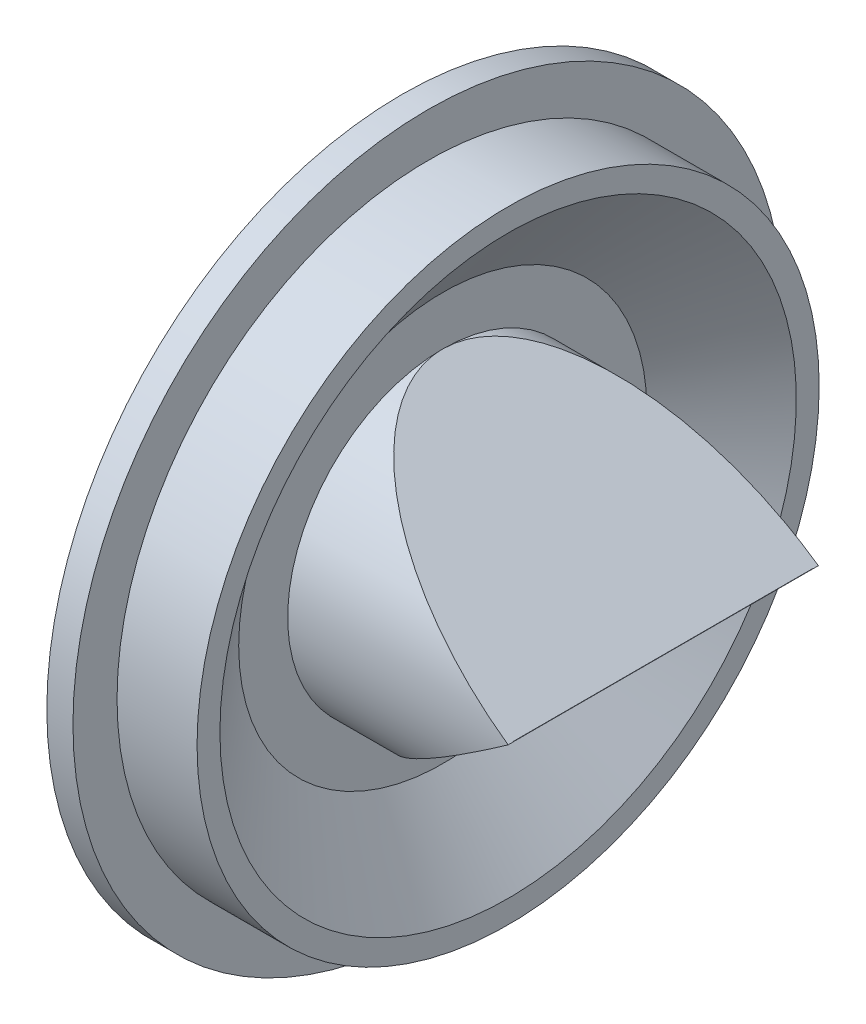
ISO-10303-21;
HEADER;
FILE_DESCRIPTION(('STEP AP214'),'2;1');
FILE_NAME('part.step','',(''),(''),'','','');
FILE_SCHEMA(('AUTOMOTIVE_DESIGN { 1 0 10303 214 1 1 1 1 }'));
ENDSEC;
DATA;
#1=APPLICATION_CONTEXT('core data for automotive mechanical design processes');
#2=APPLICATION_PROTOCOL_DEFINITION('international standard','automotive_design',2000,#1);
#3=PRODUCT_CONTEXT('',#1,'mechanical');
#4=PRODUCT('Part','Part','',(#3));
#5=PRODUCT_RELATED_PRODUCT_CATEGORY('part','',(#4));
#6=PRODUCT_DEFINITION_FORMATION('','',#4);
#7=PRODUCT_DEFINITION_CONTEXT('part definition',#1,'design');
#8=PRODUCT_DEFINITION('design','',#6,#7);
#9=PRODUCT_DEFINITION_SHAPE('','',#8);
#10=(LENGTH_UNIT() NAMED_UNIT(*) SI_UNIT(.MILLI.,.METRE.));
#11=(NAMED_UNIT(*) PLANE_ANGLE_UNIT() SI_UNIT($,.RADIAN.));
#12=(NAMED_UNIT(*) SI_UNIT($,.STERADIAN.) SOLID_ANGLE_UNIT());
#13=UNCERTAINTY_MEASURE_WITH_UNIT(LENGTH_MEASURE(1.E-05),#10,'distance_accuracy_value','');
#14=(GEOMETRIC_REPRESENTATION_CONTEXT(3) GLOBAL_UNCERTAINTY_ASSIGNED_CONTEXT((#13)) GLOBAL_UNIT_ASSIGNED_CONTEXT((#10,
#11,#12)) REPRESENTATION_CONTEXT('',''));
#15=CARTESIAN_POINT('',(0.,0.,0.));
#16=DIRECTION('',(0.,0.,1.));
#17=DIRECTION('',(1.,0.,0.));
#18=AXIS2_PLACEMENT_3D('',#15,#16,#17);
#19=CARTESIAN_POINT('',(0.,0.,0.));
#20=DIRECTION('',(-1.,0.,0.));
#21=DIRECTION('',(0.,0.,1.));
#22=AXIS2_PLACEMENT_3D('',#19,#20,#21);
#23=CYLINDRICAL_SURFACE('',#22,18.75);
#24=CARTESIAN_POINT('',(6.2,0.,0.));
#25=DIRECTION('',(-1.,0.,0.));
#26=DIRECTION('',(0.,0.,1.));
#27=AXIS2_PLACEMENT_3D('',#24,#25,#26);
#28=CIRCLE('',#27,18.75);
#29=CARTESIAN_POINT('',(6.2,0.,18.75));
#30=VERTEX_POINT('',#29);
#31=EDGE_CURVE('E125',#30,#30,#28,.T.);
#32=ORIENTED_EDGE('',*,*,#31,.F.);
#33=EDGE_LOOP('',(#32));
#34=FACE_BOUND('',#33,.T.);
#35=CARTESIAN_POINT('',(0.,0.,0.));
#36=DIRECTION('',(-1.,0.,0.));
#37=DIRECTION('',(0.,0.,1.));
#38=AXIS2_PLACEMENT_3D('',#35,#36,#37);
#39=CIRCLE('',#38,18.75);
#40=CARTESIAN_POINT('',(0.,0.,18.75));
#41=VERTEX_POINT('',#40);
#42=EDGE_CURVE('E159',#41,#41,#39,.T.);
#43=ORIENTED_EDGE('',*,*,#42,.T.);
#44=EDGE_LOOP('',(#43));
#45=FACE_BOUND('',#44,.T.);
#46=ADVANCED_FACE('F40',(#34,#45),#23,.F.);
#47=CARTESIAN_POINT('',(0.,18.75,0.));
#48=DIRECTION('',(1.,0.,0.));
#49=DIRECTION('',(0.,0.,-1.));
#50=AXIS2_PLACEMENT_3D('',#47,#48,#49);
#51=PLANE('',#50);
#52=ORIENTED_EDGE('',*,*,#42,.F.);
#53=EDGE_LOOP('',(#52));
#54=FACE_BOUND('',#53,.T.);
#55=CARTESIAN_POINT('',(0.,0.,0.));
#56=DIRECTION('',(-1.,0.,0.));
#57=DIRECTION('',(0.,0.,1.));
#58=AXIS2_PLACEMENT_3D('',#55,#56,#57);
#59=CIRCLE('',#58,21.75);
#60=CARTESIAN_POINT('',(0.,0.,21.75));
#61=VERTEX_POINT('',#60);
#62=EDGE_CURVE('E156',#61,#61,#59,.T.);
#63=ORIENTED_EDGE('',*,*,#62,.T.);
#64=EDGE_LOOP('',(#63));
#65=FACE_BOUND('',#64,.T.);
#66=ADVANCED_FACE('F210',(#54,#65),#51,.F.);
#67=CARTESIAN_POINT('',(0.,0.,0.));
#68=DIRECTION('',(-1.,0.,0.));
#69=DIRECTION('',(0.,0.,1.));
#70=AXIS2_PLACEMENT_3D('',#67,#68,#69);
#71=CYLINDRICAL_SURFACE('',#70,21.75);
#72=ORIENTED_EDGE('',*,*,#62,.F.);
#73=EDGE_LOOP('',(#72));
#74=FACE_BOUND('',#73,.T.);
#75=CARTESIAN_POINT('',(1.6,0.,0.));
#76=DIRECTION('',(-1.,0.,0.));
#77=DIRECTION('',(0.,0.,1.));
#78=AXIS2_PLACEMENT_3D('',#75,#76,#77);
#79=CIRCLE('',#78,21.75);
#80=CARTESIAN_POINT('',(1.6,0.,21.75));
#81=VERTEX_POINT('',#80);
#82=EDGE_CURVE('E153',#81,#81,#79,.T.);
#83=ORIENTED_EDGE('',*,*,#82,.T.);
#84=EDGE_LOOP('',(#83));
#85=FACE_BOUND('',#84,.T.);
#86=ADVANCED_FACE('F216',(#74,#85),#71,.T.);
#87=CARTESIAN_POINT('',(1.6,21.75,0.));
#88=DIRECTION('',(-1.,0.,0.));
#89=DIRECTION('',(0.,0.,1.));
#90=AXIS2_PLACEMENT_3D('',#87,#88,#89);
#91=PLANE('',#90);
#92=ORIENTED_EDGE('',*,*,#82,.F.);
#93=EDGE_LOOP('',(#92));
#94=FACE_BOUND('',#93,.T.);
#95=CARTESIAN_POINT('',(1.6,0.,0.));
#96=DIRECTION('',(-1.,0.,0.));
#97=DIRECTION('',(0.,0.,1.));
#98=AXIS2_PLACEMENT_3D('',#95,#96,#97);
#99=CIRCLE('',#98,19.05);
#100=CARTESIAN_POINT('',(1.6,0.,19.05));
#101=VERTEX_POINT('',#100);
#102=EDGE_CURVE('E150',#101,#101,#99,.T.);
#103=ORIENTED_EDGE('',*,*,#102,.T.);
#104=EDGE_LOOP('',(#103));
#105=FACE_BOUND('',#104,.T.);
#106=ADVANCED_FACE('F266',(#94,#105),#91,.F.);
#107=CARTESIAN_POINT('',(0.,0.,0.));
#108=DIRECTION('',(-1.,0.,0.));
#109=DIRECTION('',(0.,0.,1.));
#110=AXIS2_PLACEMENT_3D('',#107,#108,#109);
#111=CYLINDRICAL_SURFACE('',#110,19.05);
#112=ORIENTED_EDGE('',*,*,#102,.F.);
#113=EDGE_LOOP('',(#112));
#114=FACE_BOUND('',#113,.T.);
#115=CARTESIAN_POINT('',(6.5,0.,0.));
#116=DIRECTION('',(-1.,0.,0.));
#117=DIRECTION('',(0.,0.,1.));
#118=AXIS2_PLACEMENT_3D('',#115,#116,#117);
#119=CIRCLE('',#118,19.05);
#120=CARTESIAN_POINT('',(6.5,0.,19.05));
#121=VERTEX_POINT('',#120);
#122=EDGE_CURVE('E147',#121,#121,#119,.T.);
#123=ORIENTED_EDGE('',*,*,#122,.T.);
#124=EDGE_LOOP('',(#123));
#125=FACE_BOUND('',#124,.T.);
#126=ADVANCED_FACE('F262',(#114,#125),#111,.T.);
#127=CARTESIAN_POINT('',(6.5,19.05,0.));
#128=DIRECTION('',(-1.,0.,0.));
#129=DIRECTION('',(0.,0.,1.));
#130=AXIS2_PLACEMENT_3D('',#127,#128,#129);
#131=PLANE('',#130);
#132=ORIENTED_EDGE('',*,*,#122,.F.);
#133=EDGE_LOOP('',(#132));
#134=FACE_BOUND('',#133,.T.);
#135=CARTESIAN_POINT('',(6.5,0.,0.));
#136=DIRECTION('',(-1.,0.,0.));
#137=DIRECTION('',(0.,0.,1.));
#138=AXIS2_PLACEMENT_3D('',#135,#136,#137);
#139=CIRCLE('',#138,17.65);
#140=CARTESIAN_POINT('',(6.5,0.,17.65));
#141=VERTEX_POINT('',#140);
#142=EDGE_CURVE('E144',#141,#141,#139,.T.);
#143=ORIENTED_EDGE('',*,*,#142,.T.);
#144=EDGE_LOOP('',(#143));
#145=FACE_BOUND('',#144,.T.);
#146=ADVANCED_FACE('F258',(#134,#145),#131,.F.);
#147=CARTESIAN_POINT('',(2.5,0.,0.));
#148=DIRECTION('',(1.,0.,0.));
#149=DIRECTION('',(0.,0.,-1.));
#150=AXIS2_PLACEMENT_3D('',#147,#148,#149);
#151=CONICAL_SURFACE('',#150,12.5,0.910425652799119);
#152=ORIENTED_EDGE('',*,*,#142,.F.);
#153=EDGE_LOOP('',(#152));
#154=FACE_BOUND('',#153,.T.);
#155=CARTESIAN_POINT('',(2.5,0.,0.));
#156=DIRECTION('',(-1.,0.,0.));
#157=DIRECTION('',(0.,0.,1.));
#158=AXIS2_PLACEMENT_3D('',#155,#156,#157);
#159=CIRCLE('',#158,12.5);
#160=CARTESIAN_POINT('',(2.5,0.,12.5));
#161=VERTEX_POINT('',#160);
#162=EDGE_CURVE('E141',#161,#161,#159,.T.);
#163=ORIENTED_EDGE('',*,*,#162,.T.);
#164=EDGE_LOOP('',(#163));
#165=FACE_BOUND('',#164,.T.);
#166=ADVANCED_FACE('F254',(#154,#165),#151,.F.);
#167=CARTESIAN_POINT('',(2.5,12.5,0.));
#168=DIRECTION('',(-1.,0.,0.));
#169=DIRECTION('',(0.,0.,1.));
#170=AXIS2_PLACEMENT_3D('',#167,#168,#169);
#171=PLANE('',#170);
#172=ORIENTED_EDGE('',*,*,#162,.F.);
#173=EDGE_LOOP('',(#172));
#174=FACE_BOUND('',#173,.T.);
#175=CARTESIAN_POINT('',(2.5,0.,0.));
#176=DIRECTION('',(-1.,0.,0.));
#177=DIRECTION('',(0.,0.,1.));
#178=AXIS2_PLACEMENT_3D('',#175,#176,#177);
#179=CIRCLE('',#178,9.5);
#180=CARTESIAN_POINT('',(2.5,9.5,0.));
#181=VERTEX_POINT('',#180);
#182=CARTESIAN_POINT('',(2.5,-9.5,0.));
#183=VERTEX_POINT('',#182);
#184=EDGE_CURVE('E139',#181,#183,#179,.T.);
#185=ORIENTED_EDGE('',*,*,#184,.T.);
#186=EDGE_CURVE('E138',#183,#181,#179,.T.);
#187=ORIENTED_EDGE('',*,*,#186,.T.);
#188=EDGE_LOOP('',(#185,#187));
#189=FACE_BOUND('',#188,.T.);
#190=ADVANCED_FACE('F250',(#174,#189),#171,.F.);
#191=CARTESIAN_POINT('',(2.2,12.6028195886068,0.));
#192=DIRECTION('',(1.,0.,0.));
#193=DIRECTION('',(0.,0.,-1.));
#194=AXIS2_PLACEMENT_3D('',#191,#192,#193);
#195=PLANE('',#194);
#196=CARTESIAN_POINT('',(2.2,0.,0.));
#197=DIRECTION('',(-1.,0.,0.));
#198=DIRECTION('',(0.,0.,1.));
#199=AXIS2_PLACEMENT_3D('',#196,#197,#198);
#200=CIRCLE('',#199,12.6028195886068);
#201=CARTESIAN_POINT('',(2.2,0.,12.6028195886068));
#202=VERTEX_POINT('',#201);
#203=EDGE_CURVE('E135',#202,#202,#200,.T.);
#204=ORIENTED_EDGE('',*,*,#203,.T.);
#205=EDGE_LOOP('',(#204));
#206=FACE_BOUND('',#205,.T.);
#207=CARTESIAN_POINT('',(2.2,0.,0.));
#208=DIRECTION('',(-1.,0.,0.));
#209=DIRECTION('',(0.,0.,1.));
#210=AXIS2_PLACEMENT_3D('',#207,#208,#209);
#211=CIRCLE('',#210,9.2);
#212=CARTESIAN_POINT('',(2.2,0.,9.2));
#213=VERTEX_POINT('',#212);
#214=EDGE_CURVE('E44',#213,#213,#211,.F.);
#215=ORIENTED_EDGE('',*,*,#214,.T.);
#216=EDGE_LOOP('',(#215));
#217=FACE_BOUND('',#216,.T.);
#218=ADVANCED_FACE('F242',(#206,#217),#195,.F.);
#219=CARTESIAN_POINT('',(6.2,0.,0.));
#220=DIRECTION('',(1.,0.,0.));
#221=DIRECTION('',(0.,0.,-1.));
#222=AXIS2_PLACEMENT_3D('',#219,#220,#221);
#223=CONICAL_SURFACE('',#222,17.7528195886068,0.910425652799119);
#224=ORIENTED_EDGE('',*,*,#203,.F.);
#225=EDGE_LOOP('',(#224));
#226=FACE_BOUND('',#225,.T.);
#227=CARTESIAN_POINT('',(6.2,0.,0.));
#228=DIRECTION('',(-1.,0.,0.));
#229=DIRECTION('',(0.,0.,1.));
#230=AXIS2_PLACEMENT_3D('',#227,#228,#229);
#231=CIRCLE('',#230,17.7528195886068);
#232=CARTESIAN_POINT('',(6.2,0.,17.7528195886068));
#233=VERTEX_POINT('',#232);
#234=EDGE_CURVE('E132',#233,#233,#231,.T.);
#235=ORIENTED_EDGE('',*,*,#234,.T.);
#236=EDGE_LOOP('',(#235));
#237=FACE_BOUND('',#236,.T.);
#238=ADVANCED_FACE('F236',(#226,#237),#223,.T.);
#239=CARTESIAN_POINT('',(6.2,18.75,0.));
#240=DIRECTION('',(1.,0.,0.));
#241=DIRECTION('',(0.,0.,-1.));
#242=AXIS2_PLACEMENT_3D('',#239,#240,#241);
#243=PLANE('',#242);
#244=ORIENTED_EDGE('',*,*,#234,.F.);
#245=EDGE_LOOP('',(#244));
#246=FACE_BOUND('',#245,.T.);
#247=ORIENTED_EDGE('',*,*,#31,.T.);
#248=EDGE_LOOP('',(#247));
#249=FACE_BOUND('',#248,.T.);
#250=ADVANCED_FACE('F230',(#246,#249),#243,.F.);
#251=CARTESIAN_POINT('',(2.5,-9.5,-9.5));
#252=DIRECTION('',(-0.575493406174614,0.817806419300767,0.));
#253=DIRECTION('',(-0.817806419300767,-0.575493406174614,0.));
#254=AXIS2_PLACEMENT_3D('',#251,#252,#253);
#255=PLANE('',#254);
#256=DIRECTION('',(0.,0.,1.));
#257=VECTOR('',#256,1.);
#258=CARTESIAN_POINT('',(16.,0.,-9.5));
#259=LINE('',#258,#257);
#260=CARTESIAN_POINT('',(16.,0.,-9.5));
#261=VERTEX_POINT('',#260);
#262=CARTESIAN_POINT('',(16.,0.,-9.200005434781));
#263=VERTEX_POINT('',#262);
#264=EDGE_CURVE('E121',#261,#263,#259,.T.);
#265=ORIENTED_EDGE('',*,*,#264,.T.);
#266=CARTESIAN_POINT('',(16.,0.,0.));
#267=DIRECTION('',(-0.575493406174614,0.817806419300767,0.));
#268=DIRECTION('',(-0.817806419300767,-0.575493406174614,0.));
#269=AXIS2_PLACEMENT_3D('',#266,#267,#268);
#270=ELLIPSE('',#269,15.9862916517754,9.200005434781);
#271=CARTESIAN_POINT('',(15.9857894736842,-0.01,-9.2));
#272=VERTEX_POINT('',#271);
#273=EDGE_CURVE('E113',#263,#272,#270,.T.);
#274=ORIENTED_EDGE('',*,*,#273,.T.);
#275=DIRECTION('',(0.,0.,1.));
#276=VECTOR('',#275,1.);
#277=CARTESIAN_POINT('',(15.9857894736842,-0.0100000000000013,-9.5));
#278=LINE('',#277,#276);
#279=CARTESIAN_POINT('',(15.9857894736842,-0.01,9.19999999999999));
#280=VERTEX_POINT('',#279);
#281=EDGE_CURVE('E99',#272,#280,#278,.T.);
#282=ORIENTED_EDGE('',*,*,#281,.T.);
#283=CARTESIAN_POINT('',(16.,0.,0.));
#284=DIRECTION('',(-0.575493406174614,0.817806419300767,0.));
#285=DIRECTION('',(-0.817806419300767,-0.575493406174614,0.));
#286=AXIS2_PLACEMENT_3D('',#283,#284,#285);
#287=ELLIPSE('',#286,15.9862916517754,9.200005434781);
#288=CARTESIAN_POINT('',(16.,0.,9.20000543478099));
#289=VERTEX_POINT('',#288);
#290=EDGE_CURVE('E126',#280,#289,#287,.T.);
#291=ORIENTED_EDGE('',*,*,#290,.T.);
#292=CARTESIAN_POINT('',(16.,0.,9.5));
#293=VERTEX_POINT('',#292);
#294=EDGE_CURVE('E164',#289,#293,#259,.T.);
#295=ORIENTED_EDGE('',*,*,#294,.T.);
#296=CARTESIAN_POINT('',(16.,0.,0.));
#297=DIRECTION('',(-0.575493406174614,0.817806419300767,0.));
#298=DIRECTION('',(-0.817806419300767,-0.575493406174614,0.));
#299=AXIS2_PLACEMENT_3D('',#296,#297,#298);
#300=ELLIPSE('',#299,16.5075740192192,9.5);
#301=EDGE_CURVE('E11',#293,#183,#300,.F.);
#302=ORIENTED_EDGE('',*,*,#301,.T.);
#303=EDGE_CURVE('E49',#183,#261,#300,.F.);
#304=ORIENTED_EDGE('',*,*,#303,.T.);
#305=EDGE_LOOP('',(#265,#274,#282,#291,#295,#302,#304));
#306=FACE_BOUND('',#305,.T.);
#307=ADVANCED_FACE('F119',(#306),#255,.F.);
#308=CARTESIAN_POINT('',(16.,0.,0.));
#309=DIRECTION('',(-1.,0.,0.));
#310=DIRECTION('',(0.,0.,1.));
#311=AXIS2_PLACEMENT_3D('',#308,#309,#310);
#312=CYLINDRICAL_SURFACE('',#311,9.5);
#313=ORIENTED_EDGE('',*,*,#303,.F.);
#314=ORIENTED_EDGE('',*,*,#184,.F.);
#315=CARTESIAN_POINT('',(16.,0.,0.));
#316=DIRECTION('',(-0.575493406174614,-0.817806419300767,0.));
#317=DIRECTION('',(-0.817806419300767,0.575493406174614,0.));
#318=AXIS2_PLACEMENT_3D('',#315,#316,#317);
#319=ELLIPSE('',#318,16.5075740192192,9.5);
#320=EDGE_CURVE('E168',#261,#181,#319,.F.);
#321=ORIENTED_EDGE('',*,*,#320,.F.);
#322=EDGE_LOOP('',(#313,#314,#321));
#323=FACE_BOUND('',#322,.T.);
#324=ADVANCED_FACE('F42',(#323),#312,.T.);
#325=CARTESIAN_POINT('',(2.5,9.5,-9.5));
#326=DIRECTION('',(-0.575493406174614,-0.817806419300767,0.));
#327=DIRECTION('',(0.817806419300767,-0.575493406174614,0.));
#328=AXIS2_PLACEMENT_3D('',#325,#326,#327);
#329=PLANE('',#328);
#330=DIRECTION('',(0.,0.,-1.));
#331=VECTOR('',#330,1.);
#332=CARTESIAN_POINT('',(15.9857894736842,0.0100000000000013,-9.5));
#333=LINE('',#332,#331);
#334=CARTESIAN_POINT('',(15.9857894736842,0.0100000000000007,9.19999999999999));
#335=VERTEX_POINT('',#334);
#336=CARTESIAN_POINT('',(15.9857894736842,0.01,-9.2));
#337=VERTEX_POINT('',#336);
#338=EDGE_CURVE('E184',#335,#337,#333,.T.);
#339=ORIENTED_EDGE('',*,*,#338,.T.);
#340=CARTESIAN_POINT('',(16.,0.,0.));
#341=DIRECTION('',(-0.575493406174614,-0.817806419300767,0.));
#342=DIRECTION('',(-0.817806419300767,0.575493406174614,0.));
#343=AXIS2_PLACEMENT_3D('',#340,#341,#342);
#344=ELLIPSE('',#343,15.9862916517754,9.200005434781);
#345=EDGE_CURVE('E122',#337,#263,#344,.T.);
#346=ORIENTED_EDGE('',*,*,#345,.T.);
#347=ORIENTED_EDGE('',*,*,#264,.F.);
#348=ORIENTED_EDGE('',*,*,#320,.T.);
#349=EDGE_CURVE('E167',#181,#293,#319,.F.);
#350=ORIENTED_EDGE('',*,*,#349,.T.);
#351=ORIENTED_EDGE('',*,*,#294,.F.);
#352=CARTESIAN_POINT('',(16.,0.,0.));
#353=DIRECTION('',(-0.575493406174614,-0.817806419300767,0.));
#354=DIRECTION('',(-0.817806419300767,0.575493406174614,0.));
#355=AXIS2_PLACEMENT_3D('',#352,#353,#354);
#356=ELLIPSE('',#355,15.9862916517754,9.200005434781);
#357=EDGE_CURVE('E183',#289,#335,#356,.T.);
#358=ORIENTED_EDGE('',*,*,#357,.T.);
#359=EDGE_LOOP('',(#339,#346,#347,#348,#350,#351,#358));
#360=FACE_BOUND('',#359,.T.);
#361=ADVANCED_FACE('F177',(#360),#329,.F.);
#362=ORIENTED_EDGE('',*,*,#349,.F.);
#363=ORIENTED_EDGE('',*,*,#186,.F.);
#364=ORIENTED_EDGE('',*,*,#301,.F.);
#365=EDGE_LOOP('',(#362,#363,#364));
#366=FACE_BOUND('',#365,.T.);
#367=ADVANCED_FACE('F181',(#366),#312,.T.);
#368=CARTESIAN_POINT('',(2.32735197814762,9.25465807420977,-9.5));
#369=DIRECTION('',(-0.575493406174614,-0.817806419300767,0.));
#370=DIRECTION('',(0.817806419300767,-0.575493406174614,0.));
#371=AXIS2_PLACEMENT_3D('',#368,#369,#370);
#372=PLANE('',#371);
#373=DIRECTION('',(0.,0.,-1.));
#374=VECTOR('',#373,1.);
#375=CARTESIAN_POINT('',(15.464497662551,0.00999999999999959,-9.5));
#376=LINE('',#375,#374);
#377=CARTESIAN_POINT('',(15.464497662551,0.0100000000000007,9.19999999999999));
#378=VERTEX_POINT('',#377);
#379=CARTESIAN_POINT('',(15.464497662551,0.01,-9.2));
#380=VERTEX_POINT('',#379);
#381=EDGE_CURVE('E106',#378,#380,#376,.T.);
#382=ORIENTED_EDGE('',*,*,#381,.F.);
#383=CARTESIAN_POINT('',(15.4787081888668,0.,0.));
#384=DIRECTION('',(-0.575493406174614,-0.817806419300767,0.));
#385=DIRECTION('',(-0.817806419300767,0.575493406174614,0.));
#386=AXIS2_PLACEMENT_3D('',#383,#384,#385);
#387=ELLIPSE('',#386,15.9862822080859,9.2);
#388=EDGE_CURVE('E162',#380,#378,#387,.F.);
#389=ORIENTED_EDGE('',*,*,#388,.F.);
#390=EDGE_LOOP('',(#382,#389));
#391=FACE_BOUND('',#390,.T.);
#392=ADVANCED_FACE('F198',(#391),#372,.T.);
#393=CARTESIAN_POINT('',(2.32735197814762,-9.25465807420977,-9.5));
#394=DIRECTION('',(-0.575493406174614,0.817806419300767,0.));
#395=DIRECTION('',(-0.817806419300767,-0.575493406174614,0.));
#396=AXIS2_PLACEMENT_3D('',#393,#394,#395);
#397=PLANE('',#396);
#398=DIRECTION('',(0.,0.,1.));
#399=VECTOR('',#398,1.);
#400=CARTESIAN_POINT('',(15.464497662551,-0.00999999999999959,-9.5));
#401=LINE('',#400,#399);
#402=CARTESIAN_POINT('',(15.464497662551,-0.01,-9.19999456521579));
#403=VERTEX_POINT('',#402);
#404=CARTESIAN_POINT('',(15.464497662551,-0.01,9.19999999999999));
#405=VERTEX_POINT('',#404);
#406=EDGE_CURVE('E107',#403,#405,#401,.T.);
#407=ORIENTED_EDGE('',*,*,#406,.F.);
#408=CARTESIAN_POINT('',(15.4787081888668,0.,0.));
#409=DIRECTION('',(-0.575493406174614,0.817806419300767,0.));
#410=DIRECTION('',(-0.817806419300767,-0.575493406174614,0.));
#411=AXIS2_PLACEMENT_3D('',#408,#409,#410);
#412=ELLIPSE('',#411,15.9862822080859,9.2);
#413=EDGE_CURVE('E116',#405,#403,#412,.F.);
#414=ORIENTED_EDGE('',*,*,#413,.F.);
#415=EDGE_LOOP('',(#407,#414));
#416=FACE_BOUND('',#415,.T.);
#417=ADVANCED_FACE('F207',(#416),#397,.T.);
#418=CARTESIAN_POINT('',(16.,0.,0.));
#419=DIRECTION('',(-1.,0.,0.));
#420=DIRECTION('',(0.,0.,1.));
#421=AXIS2_PLACEMENT_3D('',#418,#419,#420);
#422=CYLINDRICAL_SURFACE('',#421,9.2);
#423=DIRECTION('',(-1.,0.,0.));
#424=VECTOR('',#423,1.);
#425=CARTESIAN_POINT('',(32.2,0.01,-9.2));
#426=LINE('',#425,#424);
#427=EDGE_CURVE('E189',#337,#380,#426,.T.);
#428=ORIENTED_EDGE('',*,*,#427,.T.);
#429=ORIENTED_EDGE('',*,*,#388,.T.);
#430=DIRECTION('',(-1.,0.,0.));
#431=VECTOR('',#430,1.);
#432=CARTESIAN_POINT('',(32.2,0.0100000000000007,9.19999999999999));
#433=LINE('',#432,#431);
#434=EDGE_CURVE('E56',#335,#378,#433,.T.);
#435=ORIENTED_EDGE('',*,*,#434,.F.);
#436=ORIENTED_EDGE('',*,*,#357,.F.);
#437=ORIENTED_EDGE('',*,*,#290,.F.);
#438=DIRECTION('',(-1.,0.,0.));
#439=VECTOR('',#438,1.);
#440=CARTESIAN_POINT('',(32.2,-0.01,9.19999999999999));
#441=LINE('',#440,#439);
#442=EDGE_CURVE('E102',#280,#405,#441,.T.);
#443=ORIENTED_EDGE('',*,*,#442,.T.);
#444=ORIENTED_EDGE('',*,*,#413,.T.);
#445=DIRECTION('',(-1.,0.,0.));
#446=VECTOR('',#445,1.);
#447=CARTESIAN_POINT('',(32.2,-0.01,-9.2));
#448=LINE('',#447,#446);
#449=EDGE_CURVE('E64',#272,#403,#448,.T.);
#450=ORIENTED_EDGE('',*,*,#449,.F.);
#451=ORIENTED_EDGE('',*,*,#273,.F.);
#452=ORIENTED_EDGE('',*,*,#345,.F.);
#453=EDGE_LOOP('',(#428,#429,#435,#436,#437,#443,#444,#450,#451,#452));
#454=FACE_BOUND('',#453,.T.);
#455=ORIENTED_EDGE('',*,*,#214,.F.);
#456=EDGE_LOOP('',(#455));
#457=FACE_BOUND('',#456,.T.);
#458=ADVANCED_FACE('F111',(#454,#457),#422,.F.);
#459=CARTESIAN_POINT('',(32.2,0.01,-9.2));
#460=DIRECTION('',(0.,1.,0.));
#461=DIRECTION('',(0.,0.,1.));
#462=AXIS2_PLACEMENT_3D('',#459,#460,#461);
#463=PLANE('',#462);
#464=ORIENTED_EDGE('',*,*,#434,.T.);
#465=ORIENTED_EDGE('',*,*,#381,.T.);
#466=ORIENTED_EDGE('',*,*,#427,.F.);
#467=ORIENTED_EDGE('',*,*,#338,.F.);
#468=EDGE_LOOP('',(#464,#465,#466,#467));
#469=FACE_BOUND('',#468,.T.);
#470=ADVANCED_FACE('F199',(#469),#463,.F.);
#471=CARTESIAN_POINT('',(32.2,-0.01,-9.2));
#472=DIRECTION('',(0.,-1.,0.));
#473=DIRECTION('',(0.,0.,-1.));
#474=AXIS2_PLACEMENT_3D('',#471,#472,#473);
#475=PLANE('',#474);
#476=ORIENTED_EDGE('',*,*,#449,.T.);
#477=ORIENTED_EDGE('',*,*,#406,.T.);
#478=ORIENTED_EDGE('',*,*,#442,.F.);
#479=ORIENTED_EDGE('',*,*,#281,.F.);
#480=EDGE_LOOP('',(#476,#477,#478,#479));
#481=FACE_BOUND('',#480,.T.);
#482=ADVANCED_FACE('F100',(#481),#475,.F.);
#483=CLOSED_SHELL('',(#46,#66,#86,#106,#126,#146,#166,#190,#218,#238,#250,#307,#324,#361,#367,
#392,#417,#458,#470,#482));
#484=MANIFOLD_SOLID_BREP('B2',#483);
#485=ADVANCED_BREP_SHAPE_REPRESENTATION('',(#18,#484),#14);
#486=SHAPE_DEFINITION_REPRESENTATION(#9,#485);
ENDSEC;
END-ISO-10303-21;
